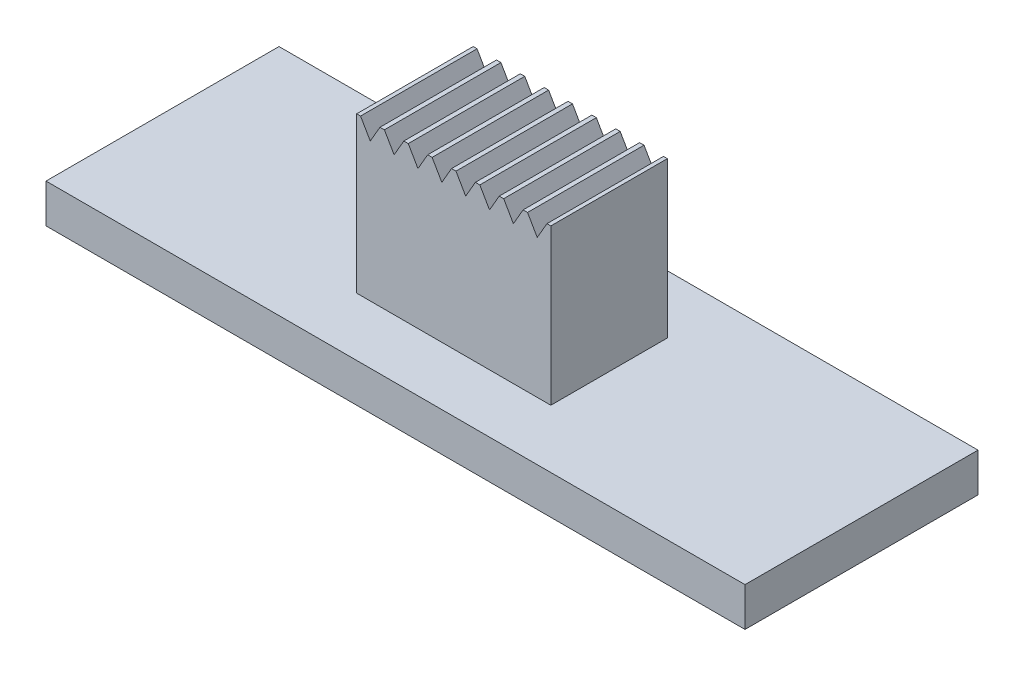
ISO-10303-21;
HEADER;
FILE_DESCRIPTION(('STEP AP214'),'2;1');
FILE_NAME('part.step','',(''),(''),'','','');
FILE_SCHEMA(('AUTOMOTIVE_DESIGN { 1 0 10303 214 1 1 1 1 }'));
ENDSEC;
DATA;
#1=APPLICATION_CONTEXT('core data for automotive mechanical design processes');
#2=APPLICATION_PROTOCOL_DEFINITION('international standard','automotive_design',2000,#1);
#3=PRODUCT_CONTEXT('',#1,'mechanical');
#4=PRODUCT('Part','Part','',(#3));
#5=PRODUCT_RELATED_PRODUCT_CATEGORY('part','',(#4));
#6=PRODUCT_DEFINITION_FORMATION('','',#4);
#7=PRODUCT_DEFINITION_CONTEXT('part definition',#1,'design');
#8=PRODUCT_DEFINITION('design','',#6,#7);
#9=PRODUCT_DEFINITION_SHAPE('','',#8);
#10=(LENGTH_UNIT() NAMED_UNIT(*) SI_UNIT(.MILLI.,.METRE.));
#11=(NAMED_UNIT(*) PLANE_ANGLE_UNIT() SI_UNIT($,.RADIAN.));
#12=(NAMED_UNIT(*) SI_UNIT($,.STERADIAN.) SOLID_ANGLE_UNIT());
#13=UNCERTAINTY_MEASURE_WITH_UNIT(LENGTH_MEASURE(1.E-05),#10,'distance_accuracy_value','');
#14=(GEOMETRIC_REPRESENTATION_CONTEXT(3) GLOBAL_UNCERTAINTY_ASSIGNED_CONTEXT((#13)) GLOBAL_UNIT_ASSIGNED_CONTEXT((#10,
#11,#12)) REPRESENTATION_CONTEXT('',''));
#15=CARTESIAN_POINT('',(0.,0.,0.));
#16=DIRECTION('',(0.,0.,1.));
#17=DIRECTION('',(1.,0.,0.));
#18=AXIS2_PLACEMENT_3D('',#15,#16,#17);
#19=CARTESIAN_POINT('',(0.,5.,0.));
#20=DIRECTION('',(0.,1.,0.));
#21=DIRECTION('',(0.,0.,1.));
#22=AXIS2_PLACEMENT_3D('',#19,#20,#21);
#23=PLANE('',#22);
#24=DIRECTION('',(0.,0.,1.));
#25=VECTOR('',#24,1.);
#26=CARTESIAN_POINT('',(-1.78571428571429,5.,0.));
#27=LINE('',#26,#25);
#28=CARTESIAN_POINT('',(-1.78571428571429,5.,-1.5));
#29=VERTEX_POINT('',#28);
#30=CARTESIAN_POINT('',(-1.78571428571429,5.,1.5));
#31=VERTEX_POINT('',#30);
#32=EDGE_CURVE('E11',#29,#31,#27,.T.);
#33=ORIENTED_EDGE('',*,*,#32,.F.);
#34=DIRECTION('',(-1.,0.,0.));
#35=VECTOR('',#34,1.);
#36=CARTESIAN_POINT('',(-2.5,5.,-1.5));
#37=LINE('',#36,#35);
#38=CARTESIAN_POINT('',(-1.9,5.,-1.5));
#39=VERTEX_POINT('',#38);
#40=EDGE_CURVE('E281',#29,#39,#37,.T.);
#41=ORIENTED_EDGE('',*,*,#40,.T.);
#42=DIRECTION('',(0.,0.,-1.));
#43=VECTOR('',#42,1.);
#44=CARTESIAN_POINT('',(-1.9,5.,0.));
#45=LINE('',#44,#43);
#46=CARTESIAN_POINT('',(-1.9,5.,1.5));
#47=VERTEX_POINT('',#46);
#48=EDGE_CURVE('E544',#47,#39,#45,.T.);
#49=ORIENTED_EDGE('',*,*,#48,.F.);
#50=DIRECTION('',(1.,0.,0.));
#51=VECTOR('',#50,1.);
#52=CARTESIAN_POINT('',(-2.5,5.,1.5));
#53=LINE('',#52,#51);
#54=EDGE_CURVE('E466',#47,#31,#53,.T.);
#55=ORIENTED_EDGE('',*,*,#54,.T.);
#56=EDGE_LOOP('',(#33,#41,#49,#55));
#57=FACE_BOUND('',#56,.T.);
#58=ADVANCED_FACE('F41',(#57),#23,.T.);
#59=DIRECTION('',(0.,0.,-1.));
#60=VECTOR('',#59,1.);
#61=CARTESIAN_POINT('',(-1.28571428571429,5.,0.));
#62=LINE('',#61,#60);
#63=CARTESIAN_POINT('',(-1.28571428571429,5.,1.5));
#64=VERTEX_POINT('',#63);
#65=CARTESIAN_POINT('',(-1.28571428571429,5.,-1.5));
#66=VERTEX_POINT('',#65);
#67=EDGE_CURVE('E50',#64,#66,#62,.T.);
#68=ORIENTED_EDGE('',*,*,#67,.F.);
#69=CARTESIAN_POINT('',(-1.17142857142857,5.,1.5));
#70=VERTEX_POINT('',#69);
#71=EDGE_CURVE('E462',#64,#70,#53,.T.);
#72=ORIENTED_EDGE('',*,*,#71,.T.);
#73=DIRECTION('',(0.,0.,1.));
#74=VECTOR('',#73,1.);
#75=CARTESIAN_POINT('',(-1.17142857142857,5.,0.));
#76=LINE('',#75,#74);
#77=CARTESIAN_POINT('',(-1.17142857142857,5.,-1.5));
#78=VERTEX_POINT('',#77);
#79=EDGE_CURVE('E579',#78,#70,#76,.T.);
#80=ORIENTED_EDGE('',*,*,#79,.F.);
#81=EDGE_CURVE('E291',#78,#66,#37,.T.);
#82=ORIENTED_EDGE('',*,*,#81,.T.);
#83=EDGE_LOOP('',(#68,#72,#80,#82));
#84=FACE_BOUND('',#83,.T.);
#85=ADVANCED_FACE('F584',(#84),#23,.T.);
#86=DIRECTION('',(0.,0.,-1.));
#87=VECTOR('',#86,1.);
#88=CARTESIAN_POINT('',(-0.671428571428574,5.,0.));
#89=LINE('',#88,#87);
#90=CARTESIAN_POINT('',(-0.671428571428574,5.,1.5));
#91=VERTEX_POINT('',#90);
#92=CARTESIAN_POINT('',(-0.671428571428574,5.,-1.5));
#93=VERTEX_POINT('',#92);
#94=EDGE_CURVE('E576',#91,#93,#89,.T.);
#95=ORIENTED_EDGE('',*,*,#94,.F.);
#96=CARTESIAN_POINT('',(-0.55714285714286,5.,1.5));
#97=VERTEX_POINT('',#96);
#98=EDGE_CURVE('E467',#91,#97,#53,.T.);
#99=ORIENTED_EDGE('',*,*,#98,.T.);
#100=DIRECTION('',(0.,0.,1.));
#101=VECTOR('',#100,1.);
#102=CARTESIAN_POINT('',(-0.55714285714286,5.,0.));
#103=LINE('',#102,#101);
#104=CARTESIAN_POINT('',(-0.55714285714286,5.,-1.5));
#105=VERTEX_POINT('',#104);
#106=EDGE_CURVE('E573',#105,#97,#103,.T.);
#107=ORIENTED_EDGE('',*,*,#106,.F.);
#108=EDGE_CURVE('E586',#105,#93,#37,.T.);
#109=ORIENTED_EDGE('',*,*,#108,.T.);
#110=EDGE_LOOP('',(#95,#99,#107,#109));
#111=FACE_BOUND('',#110,.T.);
#112=ADVANCED_FACE('F672',(#111),#23,.T.);
#113=DIRECTION('',(0.,0.,-1.));
#114=VECTOR('',#113,1.);
#115=CARTESIAN_POINT('',(-0.05714285714286,5.,0.));
#116=LINE('',#115,#114);
#117=CARTESIAN_POINT('',(-0.0571428571428602,5.,1.5));
#118=VERTEX_POINT('',#117);
#119=CARTESIAN_POINT('',(-0.05714285714286,5.,-1.5));
#120=VERTEX_POINT('',#119);
#121=EDGE_CURVE('E570',#118,#120,#116,.T.);
#122=ORIENTED_EDGE('',*,*,#121,.F.);
#123=CARTESIAN_POINT('',(0.0571428571428546,5.,1.5));
#124=VERTEX_POINT('',#123);
#125=EDGE_CURVE('E473',#118,#124,#53,.T.);
#126=ORIENTED_EDGE('',*,*,#125,.T.);
#127=DIRECTION('',(0.,0.,1.));
#128=VECTOR('',#127,1.);
#129=CARTESIAN_POINT('',(0.0571428571428546,5.,0.));
#130=LINE('',#129,#128);
#131=CARTESIAN_POINT('',(0.0571428571428546,5.,-1.5));
#132=VERTEX_POINT('',#131);
#133=EDGE_CURVE('E567',#132,#124,#130,.T.);
#134=ORIENTED_EDGE('',*,*,#133,.F.);
#135=EDGE_CURVE('E589',#132,#120,#37,.T.);
#136=ORIENTED_EDGE('',*,*,#135,.T.);
#137=EDGE_LOOP('',(#122,#126,#134,#136));
#138=FACE_BOUND('',#137,.T.);
#139=ADVANCED_FACE('F822',(#138),#23,.T.);
#140=DIRECTION('',(0.,0.,-1.));
#141=VECTOR('',#140,1.);
#142=CARTESIAN_POINT('',(0.557142857142854,5.,0.));
#143=LINE('',#142,#141);
#144=CARTESIAN_POINT('',(0.557142857142854,5.,1.5));
#145=VERTEX_POINT('',#144);
#146=CARTESIAN_POINT('',(0.557142857142854,5.,-1.5));
#147=VERTEX_POINT('',#146);
#148=EDGE_CURVE('E564',#145,#147,#143,.T.);
#149=ORIENTED_EDGE('',*,*,#148,.F.);
#150=CARTESIAN_POINT('',(0.671428571428569,5.,1.5));
#151=VERTEX_POINT('',#150);
#152=EDGE_CURVE('E623',#145,#151,#53,.T.);
#153=ORIENTED_EDGE('',*,*,#152,.T.);
#154=DIRECTION('',(0.,0.,1.));
#155=VECTOR('',#154,1.);
#156=CARTESIAN_POINT('',(0.671428571428569,5.,0.));
#157=LINE('',#156,#155);
#158=CARTESIAN_POINT('',(0.671428571428569,5.,-1.5));
#159=VERTEX_POINT('',#158);
#160=EDGE_CURVE('E561',#159,#151,#157,.T.);
#161=ORIENTED_EDGE('',*,*,#160,.F.);
#162=EDGE_CURVE('E596',#159,#147,#37,.T.);
#163=ORIENTED_EDGE('',*,*,#162,.T.);
#164=EDGE_LOOP('',(#149,#153,#161,#163));
#165=FACE_BOUND('',#164,.T.);
#166=ADVANCED_FACE('F624',(#165),#23,.T.);
#167=DIRECTION('',(0.,0.,-1.));
#168=VECTOR('',#167,1.);
#169=CARTESIAN_POINT('',(1.17142857142857,5.,0.));
#170=LINE('',#169,#168);
#171=CARTESIAN_POINT('',(1.17142857142857,5.,1.5));
#172=VERTEX_POINT('',#171);
#173=CARTESIAN_POINT('',(1.17142857142857,5.,-1.5));
#174=VERTEX_POINT('',#173);
#175=EDGE_CURVE('E558',#172,#174,#170,.T.);
#176=ORIENTED_EDGE('',*,*,#175,.F.);
#177=CARTESIAN_POINT('',(1.28571428571428,5.,1.5));
#178=VERTEX_POINT('',#177);
#179=EDGE_CURVE('E626',#172,#178,#53,.T.);
#180=ORIENTED_EDGE('',*,*,#179,.T.);
#181=DIRECTION('',(0.,0.,1.));
#182=VECTOR('',#181,1.);
#183=CARTESIAN_POINT('',(1.28571428571428,5.,0.));
#184=LINE('',#183,#182);
#185=CARTESIAN_POINT('',(1.28571428571428,5.,-1.5));
#186=VERTEX_POINT('',#185);
#187=EDGE_CURVE('E555',#186,#178,#184,.T.);
#188=ORIENTED_EDGE('',*,*,#187,.F.);
#189=EDGE_CURVE('E288',#186,#174,#37,.T.);
#190=ORIENTED_EDGE('',*,*,#189,.T.);
#191=EDGE_LOOP('',(#176,#180,#188,#190));
#192=FACE_BOUND('',#191,.T.);
#193=ADVANCED_FACE('F613',(#192),#23,.T.);
#194=DIRECTION('',(0.,0.,-1.));
#195=VECTOR('',#194,1.);
#196=CARTESIAN_POINT('',(1.78571428571428,5.,0.));
#197=LINE('',#196,#195);
#198=CARTESIAN_POINT('',(1.78571428571428,5.,1.5));
#199=VERTEX_POINT('',#198);
#200=CARTESIAN_POINT('',(1.78571428571428,5.,-1.5));
#201=VERTEX_POINT('',#200);
#202=EDGE_CURVE('E552',#199,#201,#197,.T.);
#203=ORIENTED_EDGE('',*,*,#202,.F.);
#204=CARTESIAN_POINT('',(1.9,5.,1.5));
#205=VERTEX_POINT('',#204);
#206=EDGE_CURVE('E630',#199,#205,#53,.T.);
#207=ORIENTED_EDGE('',*,*,#206,.T.);
#208=DIRECTION('',(0.,0.,1.));
#209=VECTOR('',#208,1.);
#210=CARTESIAN_POINT('',(1.9,5.,0.));
#211=LINE('',#210,#209);
#212=CARTESIAN_POINT('',(1.9,5.,-1.5));
#213=VERTEX_POINT('',#212);
#214=EDGE_CURVE('E258',#213,#205,#211,.T.);
#215=ORIENTED_EDGE('',*,*,#214,.F.);
#216=EDGE_CURVE('E279',#213,#201,#37,.T.);
#217=ORIENTED_EDGE('',*,*,#216,.T.);
#218=EDGE_LOOP('',(#203,#207,#215,#217));
#219=FACE_BOUND('',#218,.T.);
#220=ADVANCED_FACE('F682',(#219),#23,.T.);
#221=DIRECTION('',(0.,0.,1.));
#222=VECTOR('',#221,1.);
#223=CARTESIAN_POINT('',(-2.4,5.,0.));
#224=LINE('',#223,#222);
#225=CARTESIAN_POINT('',(-2.4,5.,-1.5));
#226=VERTEX_POINT('',#225);
#227=CARTESIAN_POINT('',(-2.4,5.,1.5));
#228=VERTEX_POINT('',#227);
#229=EDGE_CURVE('E259',#226,#228,#224,.T.);
#230=ORIENTED_EDGE('',*,*,#229,.F.);
#231=CARTESIAN_POINT('',(-2.5,5.,-1.5));
#232=VERTEX_POINT('',#231);
#233=EDGE_CURVE('E282',#226,#232,#37,.T.);
#234=ORIENTED_EDGE('',*,*,#233,.T.);
#235=DIRECTION('',(0.,0.,1.));
#236=VECTOR('',#235,1.);
#237=CARTESIAN_POINT('',(-2.5,5.,-1.5));
#238=LINE('',#237,#236);
#239=CARTESIAN_POINT('',(-2.5,5.,1.5));
#240=VERTEX_POINT('',#239);
#241=EDGE_CURVE('E278',#232,#240,#238,.T.);
#242=ORIENTED_EDGE('',*,*,#241,.T.);
#243=EDGE_CURVE('E471',#240,#228,#53,.T.);
#244=ORIENTED_EDGE('',*,*,#243,.T.);
#245=EDGE_LOOP('',(#230,#234,#242,#244));
#246=FACE_BOUND('',#245,.T.);
#247=ADVANCED_FACE('F646',(#246),#23,.T.);
#248=CARTESIAN_POINT('',(0.,1.,0.));
#249=DIRECTION('',(0.,-1.,0.));
#250=DIRECTION('',(0.,0.,-1.));
#251=AXIS2_PLACEMENT_3D('',#248,#249,#250);
#252=PLANE('',#251);
#253=DIRECTION('',(0.,0.,-1.));
#254=VECTOR('',#253,1.);
#255=CARTESIAN_POINT('',(9.,1.,3.));
#256=LINE('',#255,#254);
#257=CARTESIAN_POINT('',(9.,1.,3.));
#258=VERTEX_POINT('',#257);
#259=CARTESIAN_POINT('',(9.,1.,-3.));
#260=VERTEX_POINT('',#259);
#261=EDGE_CURVE('E503',#258,#260,#256,.T.);
#262=ORIENTED_EDGE('',*,*,#261,.T.);
#263=DIRECTION('',(-1.,0.,0.));
#264=VECTOR('',#263,1.);
#265=CARTESIAN_POINT('',(-9.,1.,-3.));
#266=LINE('',#265,#264);
#267=CARTESIAN_POINT('',(-9.,1.,-3.));
#268=VERTEX_POINT('',#267);
#269=EDGE_CURVE('E507',#260,#268,#266,.T.);
#270=ORIENTED_EDGE('',*,*,#269,.T.);
#271=DIRECTION('',(0.,0.,1.));
#272=VECTOR('',#271,1.);
#273=CARTESIAN_POINT('',(-9.,1.,3.));
#274=LINE('',#273,#272);
#275=CARTESIAN_POINT('',(-9.,1.,3.));
#276=VERTEX_POINT('',#275);
#277=EDGE_CURVE('E511',#268,#276,#274,.T.);
#278=ORIENTED_EDGE('',*,*,#277,.T.);
#279=DIRECTION('',(1.,0.,0.));
#280=VECTOR('',#279,1.);
#281=CARTESIAN_POINT('',(-9.,1.,3.));
#282=LINE('',#281,#280);
#283=EDGE_CURVE('E514',#276,#258,#282,.T.);
#284=ORIENTED_EDGE('',*,*,#283,.T.);
#285=EDGE_LOOP('',(#262,#270,#278,#284));
#286=FACE_BOUND('',#285,.T.);
#287=DIRECTION('',(0.,0.,-1.));
#288=VECTOR('',#287,1.);
#289=CARTESIAN_POINT('',(2.5,1.,-1.5));
#290=LINE('',#289,#288);
#291=CARTESIAN_POINT('',(2.5,1.,1.5));
#292=VERTEX_POINT('',#291);
#293=CARTESIAN_POINT('',(2.5,1.,-1.5));
#294=VERTEX_POINT('',#293);
#295=EDGE_CURVE('E308',#292,#294,#290,.T.);
#296=ORIENTED_EDGE('',*,*,#295,.F.);
#297=DIRECTION('',(1.,0.,0.));
#298=VECTOR('',#297,1.);
#299=CARTESIAN_POINT('',(-2.5,1.,1.5));
#300=LINE('',#299,#298);
#301=CARTESIAN_POINT('',(-2.5,1.,1.5));
#302=VERTEX_POINT('',#301);
#303=EDGE_CURVE('E298',#302,#292,#300,.T.);
#304=ORIENTED_EDGE('',*,*,#303,.F.);
#305=DIRECTION('',(0.,0.,1.));
#306=VECTOR('',#305,1.);
#307=CARTESIAN_POINT('',(-2.5,1.,-1.5));
#308=LINE('',#307,#306);
#309=CARTESIAN_POINT('',(-2.5,1.,-1.5));
#310=VERTEX_POINT('',#309);
#311=EDGE_CURVE('E301',#310,#302,#308,.T.);
#312=ORIENTED_EDGE('',*,*,#311,.F.);
#313=DIRECTION('',(-1.,0.,0.));
#314=VECTOR('',#313,1.);
#315=CARTESIAN_POINT('',(-2.5,1.,-1.5));
#316=LINE('',#315,#314);
#317=EDGE_CURVE('E481',#294,#310,#316,.T.);
#318=ORIENTED_EDGE('',*,*,#317,.F.);
#319=EDGE_LOOP('',(#296,#304,#312,#318));
#320=FACE_BOUND('',#319,.T.);
#321=ADVANCED_FACE('F681',(#286,#320),#252,.F.);
#322=CARTESIAN_POINT('',(9.,1.,3.));
#323=DIRECTION('',(-1.,0.,0.));
#324=DIRECTION('',(0.,0.,1.));
#325=AXIS2_PLACEMENT_3D('',#322,#323,#324);
#326=PLANE('',#325);
#327=DIRECTION('',(0.,0.,-1.));
#328=VECTOR('',#327,1.);
#329=CARTESIAN_POINT('',(9.,0.,3.));
#330=LINE('',#329,#328);
#331=CARTESIAN_POINT('',(9.,0.,3.));
#332=VERTEX_POINT('',#331);
#333=CARTESIAN_POINT('',(9.,0.,-3.));
#334=VERTEX_POINT('',#333);
#335=EDGE_CURVE('E502',#332,#334,#330,.T.);
#336=ORIENTED_EDGE('',*,*,#335,.T.);
#337=DIRECTION('',(0.,-1.,0.));
#338=VECTOR('',#337,1.);
#339=CARTESIAN_POINT('',(9.,1.,-3.));
#340=LINE('',#339,#338);
#341=EDGE_CURVE('E540',#260,#334,#340,.T.);
#342=ORIENTED_EDGE('',*,*,#341,.F.);
#343=ORIENTED_EDGE('',*,*,#261,.F.);
#344=DIRECTION('',(0.,-1.,0.));
#345=VECTOR('',#344,1.);
#346=CARTESIAN_POINT('',(9.,1.,3.));
#347=LINE('',#346,#345);
#348=EDGE_CURVE('E517',#258,#332,#347,.T.);
#349=ORIENTED_EDGE('',*,*,#348,.T.);
#350=EDGE_LOOP('',(#336,#342,#343,#349));
#351=FACE_BOUND('',#350,.T.);
#352=ADVANCED_FACE('F43',(#351),#326,.F.);
#353=CARTESIAN_POINT('',(-9.,1.,-3.));
#354=DIRECTION('',(0.,0.,1.));
#355=DIRECTION('',(1.,0.,0.));
#356=AXIS2_PLACEMENT_3D('',#353,#354,#355);
#357=PLANE('',#356);
#358=DIRECTION('',(-1.,0.,0.));
#359=VECTOR('',#358,1.);
#360=CARTESIAN_POINT('',(-9.,0.,-3.));
#361=LINE('',#360,#359);
#362=CARTESIAN_POINT('',(-9.,0.,-3.));
#363=VERTEX_POINT('',#362);
#364=EDGE_CURVE('E521',#334,#363,#361,.T.);
#365=ORIENTED_EDGE('',*,*,#364,.T.);
#366=DIRECTION('',(0.,-1.,0.));
#367=VECTOR('',#366,1.);
#368=CARTESIAN_POINT('',(-9.,1.,-3.));
#369=LINE('',#368,#367);
#370=EDGE_CURVE('E536',#268,#363,#369,.T.);
#371=ORIENTED_EDGE('',*,*,#370,.F.);
#372=ORIENTED_EDGE('',*,*,#269,.F.);
#373=ORIENTED_EDGE('',*,*,#341,.T.);
#374=EDGE_LOOP('',(#365,#371,#372,#373));
#375=FACE_BOUND('',#374,.T.);
#376=ADVANCED_FACE('F934',(#375),#357,.F.);
#377=CARTESIAN_POINT('',(-9.,1.,3.));
#378=DIRECTION('',(1.,0.,0.));
#379=DIRECTION('',(0.,0.,-1.));
#380=AXIS2_PLACEMENT_3D('',#377,#378,#379);
#381=PLANE('',#380);
#382=DIRECTION('',(0.,0.,1.));
#383=VECTOR('',#382,1.);
#384=CARTESIAN_POINT('',(-9.,0.,3.));
#385=LINE('',#384,#383);
#386=CARTESIAN_POINT('',(-9.,0.,3.));
#387=VERTEX_POINT('',#386);
#388=EDGE_CURVE('E524',#363,#387,#385,.T.);
#389=ORIENTED_EDGE('',*,*,#388,.T.);
#390=DIRECTION('',(0.,-1.,0.));
#391=VECTOR('',#390,1.);
#392=CARTESIAN_POINT('',(-9.,1.,3.));
#393=LINE('',#392,#391);
#394=EDGE_CURVE('E532',#276,#387,#393,.T.);
#395=ORIENTED_EDGE('',*,*,#394,.F.);
#396=ORIENTED_EDGE('',*,*,#277,.F.);
#397=ORIENTED_EDGE('',*,*,#370,.T.);
#398=EDGE_LOOP('',(#389,#395,#396,#397));
#399=FACE_BOUND('',#398,.T.);
#400=ADVANCED_FACE('F925',(#399),#381,.F.);
#401=CARTESIAN_POINT('',(-9.,1.,3.));
#402=DIRECTION('',(0.,0.,-1.));
#403=DIRECTION('',(-1.,0.,0.));
#404=AXIS2_PLACEMENT_3D('',#401,#402,#403);
#405=PLANE('',#404);
#406=DIRECTION('',(1.,0.,0.));
#407=VECTOR('',#406,1.);
#408=CARTESIAN_POINT('',(-9.,0.,3.));
#409=LINE('',#408,#407);
#410=EDGE_CURVE('E508',#387,#332,#409,.T.);
#411=ORIENTED_EDGE('',*,*,#410,.T.);
#412=ORIENTED_EDGE('',*,*,#348,.F.);
#413=ORIENTED_EDGE('',*,*,#283,.F.);
#414=ORIENTED_EDGE('',*,*,#394,.T.);
#415=EDGE_LOOP('',(#411,#412,#413,#414));
#416=FACE_BOUND('',#415,.T.);
#417=ADVANCED_FACE('F916',(#416),#405,.F.);
#418=CARTESIAN_POINT('',(0.,0.,0.));
#419=DIRECTION('',(0.,-1.,0.));
#420=DIRECTION('',(0.,0.,-1.));
#421=AXIS2_PLACEMENT_3D('',#418,#419,#420);
#422=PLANE('',#421);
#423=ORIENTED_EDGE('',*,*,#335,.F.);
#424=ORIENTED_EDGE('',*,*,#410,.F.);
#425=ORIENTED_EDGE('',*,*,#388,.F.);
#426=ORIENTED_EDGE('',*,*,#364,.F.);
#427=EDGE_LOOP('',(#423,#424,#425,#426));
#428=FACE_BOUND('',#427,.T.);
#429=ADVANCED_FACE('F903',(#428),#422,.T.);
#430=CARTESIAN_POINT('',(2.5,5.,-1.5));
#431=DIRECTION('',(-1.,0.,0.));
#432=DIRECTION('',(0.,0.,1.));
#433=AXIS2_PLACEMENT_3D('',#430,#431,#432);
#434=PLANE('',#433);
#435=ORIENTED_EDGE('',*,*,#295,.T.);
#436=DIRECTION('',(0.,-1.,0.));
#437=VECTOR('',#436,1.);
#438=CARTESIAN_POINT('',(2.5,5.,-1.5));
#439=LINE('',#438,#437);
#440=CARTESIAN_POINT('',(2.5,5.,-1.5));
#441=VERTEX_POINT('',#440);
#442=EDGE_CURVE('E499',#441,#294,#439,.T.);
#443=ORIENTED_EDGE('',*,*,#442,.F.);
#444=DIRECTION('',(0.,0.,-1.));
#445=VECTOR('',#444,1.);
#446=CARTESIAN_POINT('',(2.5,5.,-1.5));
#447=LINE('',#446,#445);
#448=CARTESIAN_POINT('',(2.5,5.,1.5));
#449=VERTEX_POINT('',#448);
#450=EDGE_CURVE('E275',#449,#441,#447,.T.);
#451=ORIENTED_EDGE('',*,*,#450,.F.);
#452=DIRECTION('',(0.,-1.,0.));
#453=VECTOR('',#452,1.);
#454=CARTESIAN_POINT('',(2.5,5.,1.5));
#455=LINE('',#454,#453);
#456=EDGE_CURVE('E477',#449,#292,#455,.T.);
#457=ORIENTED_EDGE('',*,*,#456,.T.);
#458=EDGE_LOOP('',(#435,#443,#451,#457));
#459=FACE_BOUND('',#458,.T.);
#460=ADVANCED_FACE('F639',(#459),#434,.F.);
#461=CARTESIAN_POINT('',(-2.5,5.,-1.5));
#462=DIRECTION('',(0.,0.,1.));
#463=DIRECTION('',(1.,0.,0.));
#464=AXIS2_PLACEMENT_3D('',#461,#462,#463);
#465=PLANE('',#464);
#466=ORIENTED_EDGE('',*,*,#40,.F.);
#467=DIRECTION('',(0.5,-0.866025403784439,0.));
#468=VECTOR('',#467,1.);
#469=CARTESIAN_POINT('',(-1.96428571428572,5.30929478706587,-1.5));
#470=LINE('',#469,#468);
#471=CARTESIAN_POINT('',(-1.53571428571429,4.56698729810778,-1.5));
#472=VERTEX_POINT('',#471);
#473=EDGE_CURVE('E325',#29,#472,#470,.T.);
#474=ORIENTED_EDGE('',*,*,#473,.T.);
#475=DIRECTION('',(0.499999999999999,0.866025403784439,0.));
#476=VECTOR('',#475,1.);
#477=CARTESIAN_POINT('',(-1.58928571428572,4.47419886198802,-1.5));
#478=LINE('',#477,#476);
#479=EDGE_CURVE('E333',#472,#66,#478,.T.);
#480=ORIENTED_EDGE('',*,*,#479,.T.);
#481=ORIENTED_EDGE('',*,*,#81,.F.);
#482=DIRECTION('',(0.5,-0.866025403784439,0.));
#483=VECTOR('',#482,1.);
#484=CARTESIAN_POINT('',(-1.50357142857143,5.57528830394252,-1.5));
#485=LINE('',#484,#483);
#486=CARTESIAN_POINT('',(-0.921428571428574,4.56698729810778,-1.5));
#487=VERTEX_POINT('',#486);
#488=EDGE_CURVE('E341',#78,#487,#485,.T.);
#489=ORIENTED_EDGE('',*,*,#488,.T.);
#490=DIRECTION('',(0.499999999999999,0.866025403784439,0.));
#491=VECTOR('',#490,1.);
#492=CARTESIAN_POINT('',(-1.12857142857143,4.20820534511137,-1.5));
#493=LINE('',#492,#491);
#494=EDGE_CURVE('E349',#487,#93,#493,.T.);
#495=ORIENTED_EDGE('',*,*,#494,.T.);
#496=ORIENTED_EDGE('',*,*,#108,.F.);
#497=DIRECTION('',(0.5,-0.866025403784439,0.));
#498=VECTOR('',#497,1.);
#499=CARTESIAN_POINT('',(-1.04285714285715,5.84128182081917,-1.5));
#500=LINE('',#499,#498);
#501=CARTESIAN_POINT('',(-0.30714285714286,4.56698729810778,-1.5));
#502=VERTEX_POINT('',#501);
#503=EDGE_CURVE('E357',#105,#502,#500,.T.);
#504=ORIENTED_EDGE('',*,*,#503,.T.);
#505=DIRECTION('',(0.499999999999999,0.866025403784439,0.));
#506=VECTOR('',#505,1.);
#507=CARTESIAN_POINT('',(-0.667857142857144,3.94221182823472,-1.5));
#508=LINE('',#507,#506);
#509=EDGE_CURVE('E365',#502,#120,#508,.T.);
#510=ORIENTED_EDGE('',*,*,#509,.T.);
#511=ORIENTED_EDGE('',*,*,#135,.F.);
#512=DIRECTION('',(0.5,-0.866025403784439,0.));
#513=VECTOR('',#512,1.);
#514=CARTESIAN_POINT('',(-0.58214285714286,6.10727533769582,-1.5));
#515=LINE('',#514,#513);
#516=CARTESIAN_POINT('',(0.307142857142855,4.56698729810778,-1.5));
#517=VERTEX_POINT('',#516);
#518=EDGE_CURVE('E373',#132,#517,#515,.T.);
#519=ORIENTED_EDGE('',*,*,#518,.T.);
#520=DIRECTION('',(0.499999999999999,0.866025403784439,0.));
#521=VECTOR('',#520,1.);
#522=CARTESIAN_POINT('',(-0.207142857142857,3.67621831135807,-1.5));
#523=LINE('',#522,#521);
#524=EDGE_CURVE('E381',#517,#147,#523,.T.);
#525=ORIENTED_EDGE('',*,*,#524,.T.);
#526=ORIENTED_EDGE('',*,*,#162,.F.);
#527=DIRECTION('',(0.5,-0.866025403784439,0.));
#528=VECTOR('',#527,1.);
#529=CARTESIAN_POINT('',(-0.121428571428574,6.37326885457247,-1.5));
#530=LINE('',#529,#528);
#531=CARTESIAN_POINT('',(0.921428571428569,4.56698729810778,-1.5));
#532=VERTEX_POINT('',#531);
#533=EDGE_CURVE('E389',#159,#532,#530,.T.);
#534=ORIENTED_EDGE('',*,*,#533,.T.);
#535=DIRECTION('',(0.499999999999999,0.866025403784439,0.));
#536=VECTOR('',#535,1.);
#537=CARTESIAN_POINT('',(0.253571428571429,3.41022479448143,-1.5));
#538=LINE('',#537,#536);
#539=EDGE_CURVE('E397',#532,#174,#538,.T.);
#540=ORIENTED_EDGE('',*,*,#539,.T.);
#541=ORIENTED_EDGE('',*,*,#189,.F.);
#542=DIRECTION('',(0.5,-0.866025403784439,0.));
#543=VECTOR('',#542,1.);
#544=CARTESIAN_POINT('',(0.339285714285711,6.63926237144912,-1.5));
#545=LINE('',#544,#543);
#546=CARTESIAN_POINT('',(1.53571428571428,4.56698729810778,-1.5));
#547=VERTEX_POINT('',#546);
#548=EDGE_CURVE('E405',#186,#547,#545,.T.);
#549=ORIENTED_EDGE('',*,*,#548,.T.);
#550=DIRECTION('',(0.499999999999999,0.866025403784439,0.));
#551=VECTOR('',#550,1.);
#552=CARTESIAN_POINT('',(0.714285714285715,3.14423127760478,-1.5));
#553=LINE('',#552,#551);
#554=EDGE_CURVE('E413',#547,#201,#553,.T.);
#555=ORIENTED_EDGE('',*,*,#554,.T.);
#556=ORIENTED_EDGE('',*,*,#216,.F.);
#557=DIRECTION('',(0.5,-0.866025403784439,0.));
#558=VECTOR('',#557,1.);
#559=CARTESIAN_POINT('',(0.799999999999997,6.90525588832576,-1.5));
#560=LINE('',#559,#558);
#561=CARTESIAN_POINT('',(2.15,4.56698729810778,-1.5));
#562=VERTEX_POINT('',#561);
#563=EDGE_CURVE('E269',#213,#562,#560,.T.);
#564=ORIENTED_EDGE('',*,*,#563,.T.);
#565=DIRECTION('',(0.499999999999999,0.866025403784439,0.));
#566=VECTOR('',#565,1.);
#567=CARTESIAN_POINT('',(1.175,2.87823776072813,-1.5));
#568=LINE('',#567,#566);
#569=CARTESIAN_POINT('',(2.4,5.,-1.5));
#570=VERTEX_POINT('',#569);
#571=EDGE_CURVE('E252',#562,#570,#568,.T.);
#572=ORIENTED_EDGE('',*,*,#571,.T.);
#573=EDGE_CURVE('E266',#441,#570,#37,.T.);
#574=ORIENTED_EDGE('',*,*,#573,.F.);
#575=ORIENTED_EDGE('',*,*,#442,.T.);
#576=ORIENTED_EDGE('',*,*,#317,.T.);
#577=DIRECTION('',(0.,-1.,0.));
#578=VECTOR('',#577,1.);
#579=CARTESIAN_POINT('',(-2.5,5.,-1.5));
#580=LINE('',#579,#578);
#581=EDGE_CURVE('E495',#232,#310,#580,.T.);
#582=ORIENTED_EDGE('',*,*,#581,.F.);
#583=ORIENTED_EDGE('',*,*,#233,.F.);
#584=DIRECTION('',(0.5,-0.866025403784439,0.));
#585=VECTOR('',#584,1.);
#586=CARTESIAN_POINT('',(-2.425,5.04330127018922,-1.5));
#587=LINE('',#586,#585);
#588=CARTESIAN_POINT('',(-2.15,4.56698729810778,-1.5));
#589=VERTEX_POINT('',#588);
#590=EDGE_CURVE('E304',#226,#589,#587,.T.);
#591=ORIENTED_EDGE('',*,*,#590,.T.);
#592=DIRECTION('',(0.499999999999999,0.866025403784439,0.));
#593=VECTOR('',#592,1.);
#594=CARTESIAN_POINT('',(-2.05,4.74019237886467,-1.5));
#595=LINE('',#594,#593);
#596=EDGE_CURVE('E313',#589,#39,#595,.T.);
#597=ORIENTED_EDGE('',*,*,#596,.T.);
#598=EDGE_LOOP('',(#466,#474,#480,#481,#489,#495,#496,#504,#510,#511,#519,#525,#526,#534,#540,
#541,#549,#555,#556,#564,#572,#574,#575,#576,#582,#583,#591,#597));
#599=FACE_BOUND('',#598,.T.);
#600=ADVANCED_FACE('F264',(#599),#465,.F.);
#601=CARTESIAN_POINT('',(-2.5,5.,-1.5));
#602=DIRECTION('',(1.,0.,0.));
#603=DIRECTION('',(0.,0.,-1.));
#604=AXIS2_PLACEMENT_3D('',#601,#602,#603);
#605=PLANE('',#604);
#606=ORIENTED_EDGE('',*,*,#311,.T.);
#607=DIRECTION('',(0.,-1.,0.));
#608=VECTOR('',#607,1.);
#609=CARTESIAN_POINT('',(-2.5,5.,1.5));
#610=LINE('',#609,#608);
#611=EDGE_CURVE('E491',#240,#302,#610,.T.);
#612=ORIENTED_EDGE('',*,*,#611,.F.);
#613=ORIENTED_EDGE('',*,*,#241,.F.);
#614=ORIENTED_EDGE('',*,*,#581,.T.);
#615=EDGE_LOOP('',(#606,#612,#613,#614));
#616=FACE_BOUND('',#615,.T.);
#617=ADVANCED_FACE('F643',(#616),#605,.F.);
#618=CARTESIAN_POINT('',(-2.5,5.,1.5));
#619=DIRECTION('',(0.,0.,-1.));
#620=DIRECTION('',(-1.,0.,0.));
#621=AXIS2_PLACEMENT_3D('',#618,#619,#620);
#622=PLANE('',#621);
#623=DIRECTION('',(-0.499999999999999,-0.866025403784439,0.));
#624=VECTOR('',#623,1.);
#625=CARTESIAN_POINT('',(-1.58928571428572,4.47419886198802,1.5));
#626=LINE('',#625,#624);
#627=CARTESIAN_POINT('',(-1.53571428571429,4.56698729810778,1.5));
#628=VERTEX_POINT('',#627);
#629=EDGE_CURVE('E337',#64,#628,#626,.T.);
#630=ORIENTED_EDGE('',*,*,#629,.T.);
#631=DIRECTION('',(-0.5,0.866025403784439,0.));
#632=VECTOR('',#631,1.);
#633=CARTESIAN_POINT('',(-1.96428571428572,5.30929478706587,1.5));
#634=LINE('',#633,#632);
#635=EDGE_CURVE('E329',#628,#31,#634,.T.);
#636=ORIENTED_EDGE('',*,*,#635,.T.);
#637=ORIENTED_EDGE('',*,*,#54,.F.);
#638=DIRECTION('',(-0.499999999999999,-0.866025403784439,0.));
#639=VECTOR('',#638,1.);
#640=CARTESIAN_POINT('',(-2.05,4.74019237886467,1.5));
#641=LINE('',#640,#639);
#642=CARTESIAN_POINT('',(-2.15,4.56698729810778,1.5));
#643=VERTEX_POINT('',#642);
#644=EDGE_CURVE('E317',#47,#643,#641,.T.);
#645=ORIENTED_EDGE('',*,*,#644,.T.);
#646=DIRECTION('',(-0.5,0.866025403784439,0.));
#647=VECTOR('',#646,1.);
#648=CARTESIAN_POINT('',(-2.425,5.04330127018922,1.5));
#649=LINE('',#648,#647);
#650=EDGE_CURVE('E309',#643,#228,#649,.T.);
#651=ORIENTED_EDGE('',*,*,#650,.T.);
#652=ORIENTED_EDGE('',*,*,#243,.F.);
#653=ORIENTED_EDGE('',*,*,#611,.T.);
#654=ORIENTED_EDGE('',*,*,#303,.T.);
#655=ORIENTED_EDGE('',*,*,#456,.F.);
#656=CARTESIAN_POINT('',(2.4,5.,1.5));
#657=VERTEX_POINT('',#656);
#658=EDGE_CURVE('E285',#657,#449,#53,.T.);
#659=ORIENTED_EDGE('',*,*,#658,.F.);
#660=DIRECTION('',(-0.499999999999999,-0.866025403784439,0.));
#661=VECTOR('',#660,1.);
#662=CARTESIAN_POINT('',(1.175,2.87823776072813,1.5));
#663=LINE('',#662,#661);
#664=CARTESIAN_POINT('',(2.15,4.56698729810778,1.5));
#665=VERTEX_POINT('',#664);
#666=EDGE_CURVE('E57',#657,#665,#663,.T.);
#667=ORIENTED_EDGE('',*,*,#666,.T.);
#668=DIRECTION('',(-0.5,0.866025403784439,0.));
#669=VECTOR('',#668,1.);
#670=CARTESIAN_POINT('',(0.799999999999997,6.90525588832576,1.5));
#671=LINE('',#670,#669);
#672=EDGE_CURVE('E271',#665,#205,#671,.T.);
#673=ORIENTED_EDGE('',*,*,#672,.T.);
#674=ORIENTED_EDGE('',*,*,#206,.F.);
#675=DIRECTION('',(-0.499999999999999,-0.866025403784439,0.));
#676=VECTOR('',#675,1.);
#677=CARTESIAN_POINT('',(0.714285714285715,3.14423127760478,1.5));
#678=LINE('',#677,#676);
#679=CARTESIAN_POINT('',(1.53571428571428,4.56698729810778,1.5));
#680=VERTEX_POINT('',#679);
#681=EDGE_CURVE('E65',#199,#680,#678,.T.);
#682=ORIENTED_EDGE('',*,*,#681,.T.);
#683=DIRECTION('',(-0.5,0.866025403784439,0.));
#684=VECTOR('',#683,1.);
#685=CARTESIAN_POINT('',(0.339285714285711,6.63926237144912,1.5));
#686=LINE('',#685,#684);
#687=EDGE_CURVE('E409',#680,#178,#686,.T.);
#688=ORIENTED_EDGE('',*,*,#687,.T.);
#689=ORIENTED_EDGE('',*,*,#179,.F.);
#690=DIRECTION('',(-0.499999999999999,-0.866025403784439,0.));
#691=VECTOR('',#690,1.);
#692=CARTESIAN_POINT('',(0.253571428571429,3.41022479448143,1.5));
#693=LINE('',#692,#691);
#694=CARTESIAN_POINT('',(0.921428571428569,4.56698729810778,1.5));
#695=VERTEX_POINT('',#694);
#696=EDGE_CURVE('E401',#172,#695,#693,.T.);
#697=ORIENTED_EDGE('',*,*,#696,.T.);
#698=DIRECTION('',(-0.5,0.866025403784439,0.));
#699=VECTOR('',#698,1.);
#700=CARTESIAN_POINT('',(-0.121428571428574,6.37326885457247,1.5));
#701=LINE('',#700,#699);
#702=EDGE_CURVE('E393',#695,#151,#701,.T.);
#703=ORIENTED_EDGE('',*,*,#702,.T.);
#704=ORIENTED_EDGE('',*,*,#152,.F.);
#705=DIRECTION('',(-0.499999999999999,-0.866025403784439,0.));
#706=VECTOR('',#705,1.);
#707=CARTESIAN_POINT('',(-0.207142857142857,3.67621831135807,1.5));
#708=LINE('',#707,#706);
#709=CARTESIAN_POINT('',(0.307142857142855,4.56698729810778,1.5));
#710=VERTEX_POINT('',#709);
#711=EDGE_CURVE('E385',#145,#710,#708,.T.);
#712=ORIENTED_EDGE('',*,*,#711,.T.);
#713=DIRECTION('',(-0.5,0.866025403784439,0.));
#714=VECTOR('',#713,1.);
#715=CARTESIAN_POINT('',(-0.58214285714286,6.10727533769582,1.5));
#716=LINE('',#715,#714);
#717=EDGE_CURVE('E377',#710,#124,#716,.T.);
#718=ORIENTED_EDGE('',*,*,#717,.T.);
#719=ORIENTED_EDGE('',*,*,#125,.F.);
#720=DIRECTION('',(-0.499999999999999,-0.866025403784439,0.));
#721=VECTOR('',#720,1.);
#722=CARTESIAN_POINT('',(-0.667857142857144,3.94221182823472,1.5));
#723=LINE('',#722,#721);
#724=CARTESIAN_POINT('',(-0.30714285714286,4.56698729810778,1.5));
#725=VERTEX_POINT('',#724);
#726=EDGE_CURVE('E369',#118,#725,#723,.T.);
#727=ORIENTED_EDGE('',*,*,#726,.T.);
#728=DIRECTION('',(-0.5,0.866025403784439,0.));
#729=VECTOR('',#728,1.);
#730=CARTESIAN_POINT('',(-1.04285714285715,5.84128182081917,1.5));
#731=LINE('',#730,#729);
#732=EDGE_CURVE('E361',#725,#97,#731,.T.);
#733=ORIENTED_EDGE('',*,*,#732,.T.);
#734=ORIENTED_EDGE('',*,*,#98,.F.);
#735=DIRECTION('',(-0.499999999999999,-0.866025403784439,0.));
#736=VECTOR('',#735,1.);
#737=CARTESIAN_POINT('',(-1.12857142857143,4.20820534511137,1.5));
#738=LINE('',#737,#736);
#739=CARTESIAN_POINT('',(-0.921428571428574,4.56698729810778,1.5));
#740=VERTEX_POINT('',#739);
#741=EDGE_CURVE('E353',#91,#740,#738,.T.);
#742=ORIENTED_EDGE('',*,*,#741,.T.);
#743=DIRECTION('',(-0.5,0.866025403784439,0.));
#744=VECTOR('',#743,1.);
#745=CARTESIAN_POINT('',(-1.50357142857143,5.57528830394252,1.5));
#746=LINE('',#745,#744);
#747=EDGE_CURVE('E345',#740,#70,#746,.T.);
#748=ORIENTED_EDGE('',*,*,#747,.T.);
#749=ORIENTED_EDGE('',*,*,#71,.F.);
#750=EDGE_LOOP('',(#630,#636,#637,#645,#651,#652,#653,#654,#655,#659,#667,#673,#674,#682,#688,
#689,#697,#703,#704,#712,#718,#719,#727,#733,#734,#742,#748,#749));
#751=FACE_BOUND('',#750,.T.);
#752=ADVANCED_FACE('F458',(#751),#622,.F.);
#753=DIRECTION('',(0.,0.,-1.));
#754=VECTOR('',#753,1.);
#755=CARTESIAN_POINT('',(2.4,5.,0.));
#756=LINE('',#755,#754);
#757=EDGE_CURVE('E249',#657,#570,#756,.T.);
#758=ORIENTED_EDGE('',*,*,#757,.F.);
#759=ORIENTED_EDGE('',*,*,#658,.T.);
#760=ORIENTED_EDGE('',*,*,#450,.T.);
#761=ORIENTED_EDGE('',*,*,#573,.T.);
#762=EDGE_LOOP('',(#758,#759,#760,#761));
#763=FACE_BOUND('',#762,.T.);
#764=ADVANCED_FACE('F273',(#763),#23,.T.);
#765=CARTESIAN_POINT('',(-2.4,5.,-3.));
#766=DIRECTION('',(-0.866025403784439,-0.5,0.));
#767=DIRECTION('',(0.5,-0.866025403784439,0.));
#768=AXIS2_PLACEMENT_3D('',#765,#766,#767);
#769=PLANE('',#768);
#770=ORIENTED_EDGE('',*,*,#229,.T.);
#771=ORIENTED_EDGE('',*,*,#650,.F.);
#772=DIRECTION('',(0.,0.,1.));
#773=VECTOR('',#772,1.);
#774=CARTESIAN_POINT('',(-2.15,4.56698729810778,-3.));
#775=LINE('',#774,#773);
#776=EDGE_CURVE('E321',#589,#643,#775,.T.);
#777=ORIENTED_EDGE('',*,*,#776,.F.);
#778=ORIENTED_EDGE('',*,*,#590,.F.);
#779=EDGE_LOOP('',(#770,#771,#777,#778));
#780=FACE_BOUND('',#779,.T.);
#781=ADVANCED_FACE('F649',(#780),#769,.F.);
#782=CARTESIAN_POINT('',(-2.15,4.56698729810778,-3.));
#783=DIRECTION('',(0.866025403784439,-0.499999999999999,0.));
#784=DIRECTION('',(0.499999999999999,0.866025403784439,0.));
#785=AXIS2_PLACEMENT_3D('',#782,#783,#784);
#786=PLANE('',#785);
#787=ORIENTED_EDGE('',*,*,#776,.T.);
#788=ORIENTED_EDGE('',*,*,#644,.F.);
#789=ORIENTED_EDGE('',*,*,#48,.T.);
#790=ORIENTED_EDGE('',*,*,#596,.F.);
#791=EDGE_LOOP('',(#787,#788,#789,#790));
#792=FACE_BOUND('',#791,.T.);
#793=ADVANCED_FACE('F651',(#792),#786,.F.);
#794=CARTESIAN_POINT('',(1.9,5.,-3.));
#795=DIRECTION('',(-0.866025403784439,-0.5,0.));
#796=DIRECTION('',(0.5,-0.866025403784439,0.));
#797=AXIS2_PLACEMENT_3D('',#794,#795,#796);
#798=PLANE('',#797);
#799=ORIENTED_EDGE('',*,*,#214,.T.);
#800=ORIENTED_EDGE('',*,*,#672,.F.);
#801=DIRECTION('',(0.,0.,1.));
#802=VECTOR('',#801,1.);
#803=CARTESIAN_POINT('',(2.15,4.56698729810778,-3.));
#804=LINE('',#803,#802);
#805=EDGE_CURVE('E427',#562,#665,#804,.T.);
#806=ORIENTED_EDGE('',*,*,#805,.F.);
#807=ORIENTED_EDGE('',*,*,#563,.F.);
#808=EDGE_LOOP('',(#799,#800,#806,#807));
#809=FACE_BOUND('',#808,.T.);
#810=ADVANCED_FACE('F693',(#809),#798,.F.);
#811=CARTESIAN_POINT('',(2.15,4.56698729810778,-3.));
#812=DIRECTION('',(0.866025403784439,-0.499999999999999,0.));
#813=DIRECTION('',(0.499999999999999,0.866025403784439,0.));
#814=AXIS2_PLACEMENT_3D('',#811,#812,#813);
#815=PLANE('',#814);
#816=ORIENTED_EDGE('',*,*,#805,.T.);
#817=ORIENTED_EDGE('',*,*,#666,.F.);
#818=ORIENTED_EDGE('',*,*,#757,.T.);
#819=ORIENTED_EDGE('',*,*,#571,.F.);
#820=EDGE_LOOP('',(#816,#817,#818,#819));
#821=FACE_BOUND('',#820,.T.);
#822=ADVANCED_FACE('F251',(#821),#815,.F.);
#823=CARTESIAN_POINT('',(1.28571428571428,5.,-3.));
#824=DIRECTION('',(-0.866025403784439,-0.5,0.));
#825=DIRECTION('',(0.5,-0.866025403784439,0.));
#826=AXIS2_PLACEMENT_3D('',#823,#824,#825);
#827=PLANE('',#826);
#828=ORIENTED_EDGE('',*,*,#187,.T.);
#829=ORIENTED_EDGE('',*,*,#687,.F.);
#830=DIRECTION('',(0.,0.,1.));
#831=VECTOR('',#830,1.);
#832=CARTESIAN_POINT('',(1.53571428571428,4.56698729810778,-3.));
#833=LINE('',#832,#831);
#834=EDGE_CURVE('E430',#547,#680,#833,.T.);
#835=ORIENTED_EDGE('',*,*,#834,.F.);
#836=ORIENTED_EDGE('',*,*,#548,.F.);
#837=EDGE_LOOP('',(#828,#829,#835,#836));
#838=FACE_BOUND('',#837,.T.);
#839=ADVANCED_FACE('F697',(#838),#827,.F.);
#840=CARTESIAN_POINT('',(1.53571428571428,4.56698729810778,-3.));
#841=DIRECTION('',(0.866025403784439,-0.499999999999999,0.));
#842=DIRECTION('',(0.499999999999999,0.866025403784439,0.));
#843=AXIS2_PLACEMENT_3D('',#840,#841,#842);
#844=PLANE('',#843);
#845=ORIENTED_EDGE('',*,*,#834,.T.);
#846=ORIENTED_EDGE('',*,*,#681,.F.);
#847=ORIENTED_EDGE('',*,*,#202,.T.);
#848=ORIENTED_EDGE('',*,*,#554,.F.);
#849=EDGE_LOOP('',(#845,#846,#847,#848));
#850=FACE_BOUND('',#849,.T.);
#851=ADVANCED_FACE('F695',(#850),#844,.F.);
#852=CARTESIAN_POINT('',(0.671428571428569,5.,-3.));
#853=DIRECTION('',(-0.866025403784439,-0.5,0.));
#854=DIRECTION('',(0.5,-0.866025403784439,0.));
#855=AXIS2_PLACEMENT_3D('',#852,#853,#854);
#856=PLANE('',#855);
#857=ORIENTED_EDGE('',*,*,#160,.T.);
#858=ORIENTED_EDGE('',*,*,#702,.F.);
#859=DIRECTION('',(0.,0.,1.));
#860=VECTOR('',#859,1.);
#861=CARTESIAN_POINT('',(0.921428571428569,4.56698729810778,-3.));
#862=LINE('',#861,#860);
#863=EDGE_CURVE('E433',#532,#695,#862,.T.);
#864=ORIENTED_EDGE('',*,*,#863,.F.);
#865=ORIENTED_EDGE('',*,*,#533,.F.);
#866=EDGE_LOOP('',(#857,#858,#864,#865));
#867=FACE_BOUND('',#866,.T.);
#868=ADVANCED_FACE('F620',(#867),#856,.F.);
#869=CARTESIAN_POINT('',(0.921428571428569,4.56698729810778,-3.));
#870=DIRECTION('',(0.866025403784439,-0.499999999999999,0.));
#871=DIRECTION('',(0.499999999999999,0.866025403784439,0.));
#872=AXIS2_PLACEMENT_3D('',#869,#870,#871);
#873=PLANE('',#872);
#874=ORIENTED_EDGE('',*,*,#863,.T.);
#875=ORIENTED_EDGE('',*,*,#696,.F.);
#876=ORIENTED_EDGE('',*,*,#175,.T.);
#877=ORIENTED_EDGE('',*,*,#539,.F.);
#878=EDGE_LOOP('',(#874,#875,#876,#877));
#879=FACE_BOUND('',#878,.T.);
#880=ADVANCED_FACE('F618',(#879),#873,.F.);
#881=CARTESIAN_POINT('',(0.0571428571428546,5.,-3.));
#882=DIRECTION('',(-0.866025403784439,-0.5,0.));
#883=DIRECTION('',(0.5,-0.866025403784439,0.));
#884=AXIS2_PLACEMENT_3D('',#881,#882,#883);
#885=PLANE('',#884);
#886=ORIENTED_EDGE('',*,*,#133,.T.);
#887=ORIENTED_EDGE('',*,*,#717,.F.);
#888=DIRECTION('',(0.,0.,1.));
#889=VECTOR('',#888,1.);
#890=CARTESIAN_POINT('',(0.307142857142855,4.56698729810778,-3.));
#891=LINE('',#890,#889);
#892=EDGE_CURVE('E437',#517,#710,#891,.T.);
#893=ORIENTED_EDGE('',*,*,#892,.F.);
#894=ORIENTED_EDGE('',*,*,#518,.F.);
#895=EDGE_LOOP('',(#886,#887,#893,#894));
#896=FACE_BOUND('',#895,.T.);
#897=ADVANCED_FACE('F749',(#896),#885,.F.);
#898=CARTESIAN_POINT('',(0.307142857142855,4.56698729810778,-3.));
#899=DIRECTION('',(0.866025403784439,-0.499999999999999,0.));
#900=DIRECTION('',(0.499999999999999,0.866025403784439,0.));
#901=AXIS2_PLACEMENT_3D('',#898,#899,#900);
#902=PLANE('',#901);
#903=ORIENTED_EDGE('',*,*,#892,.T.);
#904=ORIENTED_EDGE('',*,*,#711,.F.);
#905=ORIENTED_EDGE('',*,*,#148,.T.);
#906=ORIENTED_EDGE('',*,*,#524,.F.);
#907=EDGE_LOOP('',(#903,#904,#905,#906));
#908=FACE_BOUND('',#907,.T.);
#909=ADVANCED_FACE('F758',(#908),#902,.F.);
#910=CARTESIAN_POINT('',(-0.55714285714286,5.,-3.));
#911=DIRECTION('',(-0.866025403784439,-0.5,0.));
#912=DIRECTION('',(0.5,-0.866025403784439,0.));
#913=AXIS2_PLACEMENT_3D('',#910,#911,#912);
#914=PLANE('',#913);
#915=ORIENTED_EDGE('',*,*,#106,.T.);
#916=ORIENTED_EDGE('',*,*,#732,.F.);
#917=DIRECTION('',(0.,0.,1.));
#918=VECTOR('',#917,1.);
#919=CARTESIAN_POINT('',(-0.30714285714286,4.56698729810778,-3.));
#920=LINE('',#919,#918);
#921=EDGE_CURVE('E441',#502,#725,#920,.T.);
#922=ORIENTED_EDGE('',*,*,#921,.F.);
#923=ORIENTED_EDGE('',*,*,#503,.F.);
#924=EDGE_LOOP('',(#915,#916,#922,#923));
#925=FACE_BOUND('',#924,.T.);
#926=ADVANCED_FACE('F768',(#925),#914,.F.);
#927=CARTESIAN_POINT('',(-0.30714285714286,4.56698729810778,-3.));
#928=DIRECTION('',(0.866025403784439,-0.499999999999999,0.));
#929=DIRECTION('',(0.499999999999999,0.866025403784439,0.));
#930=AXIS2_PLACEMENT_3D('',#927,#928,#929);
#931=PLANE('',#930);
#932=ORIENTED_EDGE('',*,*,#921,.T.);
#933=ORIENTED_EDGE('',*,*,#726,.F.);
#934=ORIENTED_EDGE('',*,*,#121,.T.);
#935=ORIENTED_EDGE('',*,*,#509,.F.);
#936=EDGE_LOOP('',(#932,#933,#934,#935));
#937=FACE_BOUND('',#936,.T.);
#938=ADVANCED_FACE('F778',(#937),#931,.F.);
#939=CARTESIAN_POINT('',(-1.17142857142857,5.,-3.));
#940=DIRECTION('',(-0.866025403784439,-0.5,0.));
#941=DIRECTION('',(0.5,-0.866025403784439,0.));
#942=AXIS2_PLACEMENT_3D('',#939,#940,#941);
#943=PLANE('',#942);
#944=ORIENTED_EDGE('',*,*,#79,.T.);
#945=ORIENTED_EDGE('',*,*,#747,.F.);
#946=DIRECTION('',(0.,0.,1.));
#947=VECTOR('',#946,1.);
#948=CARTESIAN_POINT('',(-0.921428571428574,4.56698729810778,-3.));
#949=LINE('',#948,#947);
#950=EDGE_CURVE('E445',#487,#740,#949,.T.);
#951=ORIENTED_EDGE('',*,*,#950,.F.);
#952=ORIENTED_EDGE('',*,*,#488,.F.);
#953=EDGE_LOOP('',(#944,#945,#951,#952));
#954=FACE_BOUND('',#953,.T.);
#955=ADVANCED_FACE('F664',(#954),#943,.F.);
#956=CARTESIAN_POINT('',(-0.921428571428574,4.56698729810778,-3.));
#957=DIRECTION('',(0.866025403784439,-0.499999999999999,0.));
#958=DIRECTION('',(0.499999999999999,0.866025403784439,0.));
#959=AXIS2_PLACEMENT_3D('',#956,#957,#958);
#960=PLANE('',#959);
#961=ORIENTED_EDGE('',*,*,#950,.T.);
#962=ORIENTED_EDGE('',*,*,#741,.F.);
#963=ORIENTED_EDGE('',*,*,#94,.T.);
#964=ORIENTED_EDGE('',*,*,#494,.F.);
#965=EDGE_LOOP('',(#961,#962,#963,#964));
#966=FACE_BOUND('',#965,.T.);
#967=ADVANCED_FACE('F657',(#966),#960,.F.);
#968=CARTESIAN_POINT('',(-1.78571428571429,5.,-3.));
#969=DIRECTION('',(-0.866025403784439,-0.5,0.));
#970=DIRECTION('',(0.5,-0.866025403784439,0.));
#971=AXIS2_PLACEMENT_3D('',#968,#969,#970);
#972=PLANE('',#971);
#973=ORIENTED_EDGE('',*,*,#32,.T.);
#974=ORIENTED_EDGE('',*,*,#635,.F.);
#975=DIRECTION('',(0.,0.,1.));
#976=VECTOR('',#975,1.);
#977=CARTESIAN_POINT('',(-1.53571428571429,4.56698729810778,-3.));
#978=LINE('',#977,#976);
#979=EDGE_CURVE('E426',#472,#628,#978,.T.);
#980=ORIENTED_EDGE('',*,*,#979,.F.);
#981=ORIENTED_EDGE('',*,*,#473,.F.);
#982=EDGE_LOOP('',(#973,#974,#980,#981));
#983=FACE_BOUND('',#982,.T.);
#984=ADVANCED_FACE('F655',(#983),#972,.F.);
#985=CARTESIAN_POINT('',(-1.53571428571429,4.56698729810778,-3.));
#986=DIRECTION('',(0.866025403784439,-0.499999999999999,0.));
#987=DIRECTION('',(0.499999999999999,0.866025403784439,0.));
#988=AXIS2_PLACEMENT_3D('',#985,#986,#987);
#989=PLANE('',#988);
#990=ORIENTED_EDGE('',*,*,#979,.T.);
#991=ORIENTED_EDGE('',*,*,#629,.F.);
#992=ORIENTED_EDGE('',*,*,#67,.T.);
#993=ORIENTED_EDGE('',*,*,#479,.F.);
#994=EDGE_LOOP('',(#990,#991,#992,#993));
#995=FACE_BOUND('',#994,.T.);
#996=ADVANCED_FACE('F453',(#995),#989,.F.);
#997=CLOSED_SHELL('',(#58,#85,#112,#139,#166,#193,#220,#247,#321,#352,#376,#400,#417,#429,#460,
#600,#617,#752,#764,#781,#793,#810,#822,#839,#851,#868,#880,#897,#909,#926,#938,#955,#967,#984,#996));
#998=MANIFOLD_SOLID_BREP('B2',#997);
#999=ADVANCED_BREP_SHAPE_REPRESENTATION('',(#18,#998),#14);
#1000=SHAPE_DEFINITION_REPRESENTATION(#9,#999);
ENDSEC;
END-ISO-10303-21;
